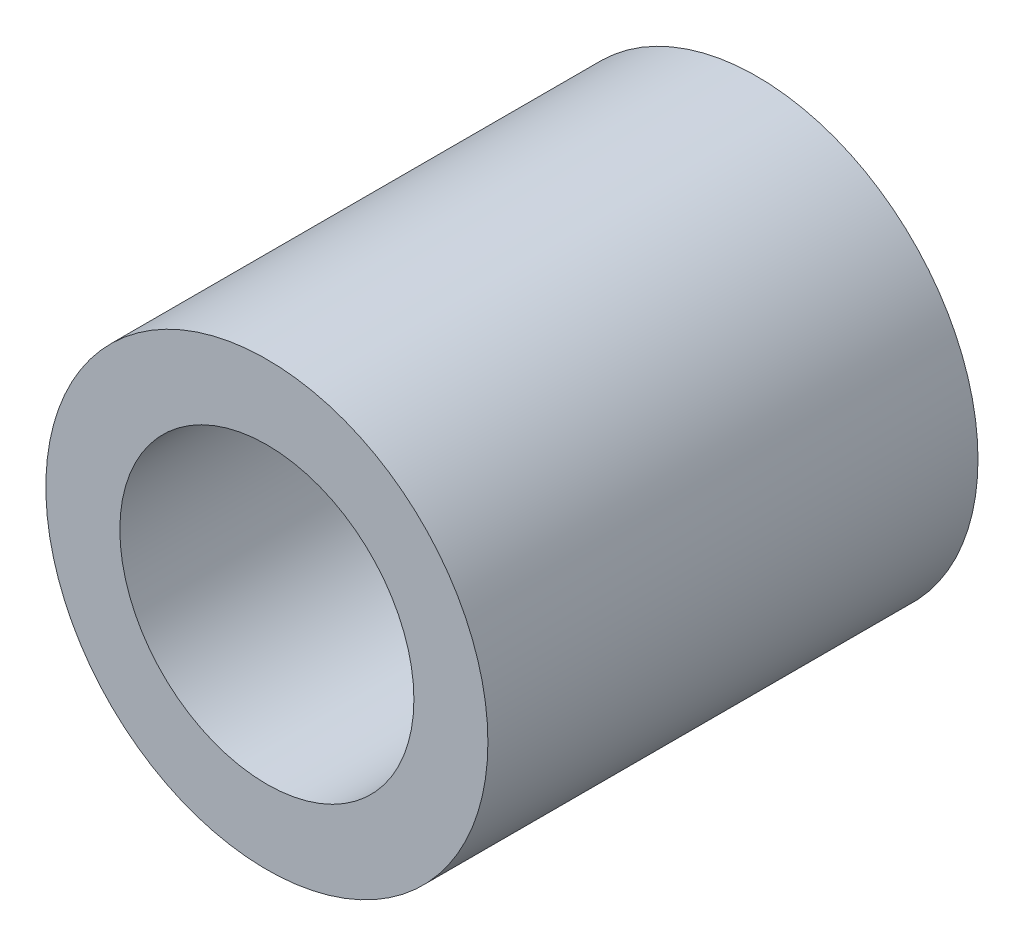
ISO-10303-21;
HEADER;
FILE_DESCRIPTION(('STEP AP214'),'2;1');
FILE_NAME('part.step','',(''),(''),'','','');
FILE_SCHEMA(('AUTOMOTIVE_DESIGN { 1 0 10303 214 1 1 1 1 }'));
ENDSEC;
DATA;
#1=APPLICATION_CONTEXT('core data for automotive mechanical design processes');
#2=APPLICATION_PROTOCOL_DEFINITION('international standard','automotive_design',2000,#1);
#3=PRODUCT_CONTEXT('',#1,'mechanical');
#4=PRODUCT('Part','Part','',(#3));
#5=PRODUCT_RELATED_PRODUCT_CATEGORY('part','',(#4));
#6=PRODUCT_DEFINITION_FORMATION('','',#4);
#7=PRODUCT_DEFINITION_CONTEXT('part definition',#1,'design');
#8=PRODUCT_DEFINITION('design','',#6,#7);
#9=PRODUCT_DEFINITION_SHAPE('','',#8);
#10=(LENGTH_UNIT() NAMED_UNIT(*) SI_UNIT(.MILLI.,.METRE.));
#11=(NAMED_UNIT(*) PLANE_ANGLE_UNIT() SI_UNIT($,.RADIAN.));
#12=(NAMED_UNIT(*) SI_UNIT($,.STERADIAN.) SOLID_ANGLE_UNIT());
#13=UNCERTAINTY_MEASURE_WITH_UNIT(LENGTH_MEASURE(1.E-05),#10,'distance_accuracy_value','');
#14=(GEOMETRIC_REPRESENTATION_CONTEXT(3) GLOBAL_UNCERTAINTY_ASSIGNED_CONTEXT((#13)) GLOBAL_UNIT_ASSIGNED_CONTEXT((#10,
#11,#12)) REPRESENTATION_CONTEXT('',''));
#15=CARTESIAN_POINT('',(0.,0.,0.));
#16=DIRECTION('',(0.,0.,1.));
#17=DIRECTION('',(1.,0.,0.));
#18=AXIS2_PLACEMENT_3D('',#15,#16,#17);
#19=CARTESIAN_POINT('',(0.,0.,5.));
#20=DIRECTION('',(0.,0.,1.));
#21=DIRECTION('',(0.999999999999999,0.,0.));
#22=AXIS2_PLACEMENT_3D('',#19,#20,#21);
#23=PLANE('',#22);
#24=CARTESIAN_POINT('',(0.,0.,5.));
#25=DIRECTION('',(0.,0.,1.));
#26=DIRECTION('',(0.999999999999999,0.,0.));
#27=AXIS2_PLACEMENT_3D('',#24,#25,#26);
#28=CIRCLE('',#27,4.51);
#29=CARTESIAN_POINT('',(4.51,0.,5.));
#30=VERTEX_POINT('',#29);
#31=EDGE_CURVE('E10',#30,#30,#28,.T.);
#32=ORIENTED_EDGE('',*,*,#31,.T.);
#33=EDGE_LOOP('',(#32));
#34=FACE_BOUND('',#33,.T.);
#35=CARTESIAN_POINT('',(0.,0.,5.));
#36=DIRECTION('',(0.,0.,1.));
#37=DIRECTION('',(0.999999999999999,0.,0.));
#38=AXIS2_PLACEMENT_3D('',#35,#36,#37);
#39=CIRCLE('',#38,3.);
#40=CARTESIAN_POINT('',(3.,0.,5.));
#41=VERTEX_POINT('',#40);
#42=EDGE_CURVE('E43',#41,#41,#39,.T.);
#43=ORIENTED_EDGE('',*,*,#42,.F.);
#44=EDGE_LOOP('',(#43));
#45=FACE_BOUND('',#44,.T.);
#46=ADVANCED_FACE('F32',(#34,#45),#23,.T.);
#47=CARTESIAN_POINT('',(0.,0.,-4.99999999999995));
#48=DIRECTION('',(0.,0.,1.));
#49=DIRECTION('',(0.999999999999999,0.,0.));
#50=AXIS2_PLACEMENT_3D('',#47,#48,#49);
#51=PLANE('',#50);
#52=CARTESIAN_POINT('',(0.,0.,-4.99999999999995));
#53=DIRECTION('',(0.,0.,1.));
#54=DIRECTION('',(0.999999999999999,0.,0.));
#55=AXIS2_PLACEMENT_3D('',#52,#53,#54);
#56=CIRCLE('',#55,4.51);
#57=CARTESIAN_POINT('',(4.51,0.,-4.99999999999995));
#58=VERTEX_POINT('',#57);
#59=EDGE_CURVE('E36',#58,#58,#56,.T.);
#60=ORIENTED_EDGE('',*,*,#59,.F.);
#61=EDGE_LOOP('',(#60));
#62=FACE_BOUND('',#61,.T.);
#63=CARTESIAN_POINT('',(0.,0.,-4.99999999999995));
#64=DIRECTION('',(0.,0.,1.));
#65=DIRECTION('',(0.999999999999999,0.,0.));
#66=AXIS2_PLACEMENT_3D('',#63,#64,#65);
#67=CIRCLE('',#66,3.);
#68=CARTESIAN_POINT('',(3.,0.,-4.99999999999995));
#69=VERTEX_POINT('',#68);
#70=EDGE_CURVE('E45',#69,#69,#67,.T.);
#71=ORIENTED_EDGE('',*,*,#70,.T.);
#72=EDGE_LOOP('',(#71));
#73=FACE_BOUND('',#72,.T.);
#74=ADVANCED_FACE('F55',(#62,#73),#51,.F.);
#75=CARTESIAN_POINT('',(0.,0.,5.));
#76=DIRECTION('',(0.,0.,-1.));
#77=DIRECTION('',(-0.999999999999999,0.,0.));
#78=AXIS2_PLACEMENT_3D('',#75,#76,#77);
#79=CYLINDRICAL_SURFACE('',#78,4.51);
#80=ORIENTED_EDGE('',*,*,#31,.F.);
#81=EDGE_LOOP('',(#80));
#82=FACE_BOUND('',#81,.T.);
#83=ORIENTED_EDGE('',*,*,#59,.T.);
#84=EDGE_LOOP('',(#83));
#85=FACE_BOUND('',#84,.T.);
#86=ADVANCED_FACE('F34',(#82,#85),#79,.T.);
#87=CARTESIAN_POINT('',(0.,0.,5.));
#88=DIRECTION('',(0.,0.,-1.));
#89=DIRECTION('',(-0.999999999999999,0.,0.));
#90=AXIS2_PLACEMENT_3D('',#87,#88,#89);
#91=CYLINDRICAL_SURFACE('',#90,3.);
#92=ORIENTED_EDGE('',*,*,#42,.T.);
#93=EDGE_LOOP('',(#92));
#94=FACE_BOUND('',#93,.T.);
#95=ORIENTED_EDGE('',*,*,#70,.F.);
#96=EDGE_LOOP('',(#95));
#97=FACE_BOUND('',#96,.T.);
#98=ADVANCED_FACE('F51',(#94,#97),#91,.F.);
#99=CLOSED_SHELL('',(#46,#74,#86,#98));
#100=MANIFOLD_SOLID_BREP('B2',#99);
#101=ADVANCED_BREP_SHAPE_REPRESENTATION('',(#18,#100),#14);
#102=SHAPE_DEFINITION_REPRESENTATION(#9,#101);
ENDSEC;
END-ISO-10303-21;
